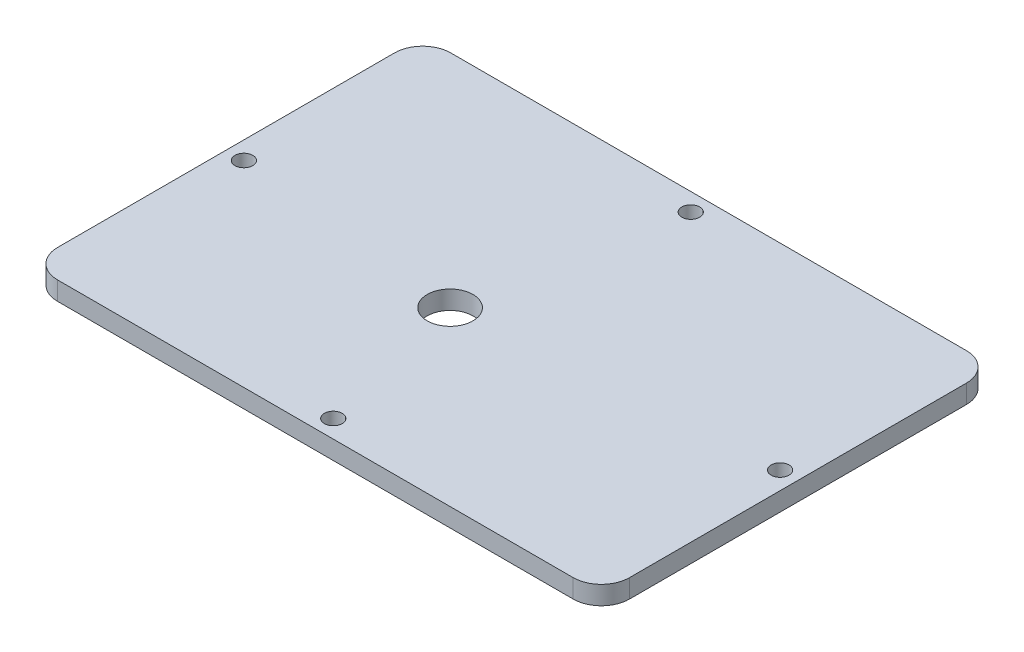
ISO-10303-21;
HEADER;
FILE_DESCRIPTION(('STEP AP214'),'2;1');
FILE_NAME('part.step','',(''),(''),'','','');
FILE_SCHEMA(('AUTOMOTIVE_DESIGN { 1 0 10303 214 1 1 1 1 }'));
ENDSEC;
DATA;
#1=APPLICATION_CONTEXT('core data for automotive mechanical design processes');
#2=APPLICATION_PROTOCOL_DEFINITION('international standard','automotive_design',2000,#1);
#3=PRODUCT_CONTEXT('',#1,'mechanical');
#4=PRODUCT('Part','Part','',(#3));
#5=PRODUCT_RELATED_PRODUCT_CATEGORY('part','',(#4));
#6=PRODUCT_DEFINITION_FORMATION('','',#4);
#7=PRODUCT_DEFINITION_CONTEXT('part definition',#1,'design');
#8=PRODUCT_DEFINITION('design','',#6,#7);
#9=PRODUCT_DEFINITION_SHAPE('','',#8);
#10=(LENGTH_UNIT() NAMED_UNIT(*) SI_UNIT(.MILLI.,.METRE.));
#11=(NAMED_UNIT(*) PLANE_ANGLE_UNIT() SI_UNIT($,.RADIAN.));
#12=(NAMED_UNIT(*) SI_UNIT($,.STERADIAN.) SOLID_ANGLE_UNIT());
#13=UNCERTAINTY_MEASURE_WITH_UNIT(LENGTH_MEASURE(1.E-05),#10,'distance_accuracy_value','');
#14=(GEOMETRIC_REPRESENTATION_CONTEXT(3) GLOBAL_UNCERTAINTY_ASSIGNED_CONTEXT((#13)) GLOBAL_UNIT_ASSIGNED_CONTEXT((#10,
#11,#12)) REPRESENTATION_CONTEXT('',''));
#15=CARTESIAN_POINT('',(0.,0.,0.));
#16=DIRECTION('',(0.,0.,1.));
#17=DIRECTION('',(1.,0.,0.));
#18=AXIS2_PLACEMENT_3D('',#15,#16,#17);
#19=CARTESIAN_POINT('',(50.8,3.302,34.925));
#20=DIRECTION('',(-1.,0.,0.));
#21=DIRECTION('',(0.,0.,1.));
#22=AXIS2_PLACEMENT_3D('',#19,#20,#21);
#23=PLANE('',#22);
#24=DIRECTION('',(0.,0.,-1.));
#25=VECTOR('',#24,1.);
#26=CARTESIAN_POINT('',(50.8,0.,34.925));
#27=LINE('',#26,#25);
#28=CARTESIAN_POINT('',(50.8,0.,29.925));
#29=VERTEX_POINT('',#28);
#30=CARTESIAN_POINT('',(50.8,0.,-29.925));
#31=VERTEX_POINT('',#30);
#32=EDGE_CURVE('E129',#29,#31,#27,.T.);
#33=ORIENTED_EDGE('',*,*,#32,.T.);
#34=DIRECTION('',(0.,-1.,0.));
#35=VECTOR('',#34,1.);
#36=CARTESIAN_POINT('',(50.8,3.302,-29.925));
#37=LINE('',#36,#35);
#38=CARTESIAN_POINT('',(50.8,3.302,-29.925));
#39=VERTEX_POINT('',#38);
#40=EDGE_CURVE('E107',#31,#39,#37,.F.);
#41=ORIENTED_EDGE('',*,*,#40,.T.);
#42=DIRECTION('',(0.,0.,-1.));
#43=VECTOR('',#42,1.);
#44=CARTESIAN_POINT('',(50.8,3.302,34.925));
#45=LINE('',#44,#43);
#46=CARTESIAN_POINT('',(50.8,3.302,29.925));
#47=VERTEX_POINT('',#46);
#48=EDGE_CURVE('E139',#47,#39,#45,.T.);
#49=ORIENTED_EDGE('',*,*,#48,.F.);
#50=DIRECTION('',(0.,-1.,0.));
#51=VECTOR('',#50,1.);
#52=CARTESIAN_POINT('',(50.8,3.302,29.925));
#53=LINE('',#52,#51);
#54=EDGE_CURVE('E112',#47,#29,#53,.T.);
#55=ORIENTED_EDGE('',*,*,#54,.T.);
#56=EDGE_LOOP('',(#33,#41,#49,#55));
#57=FACE_BOUND('',#56,.T.);
#58=ADVANCED_FACE('F36',(#57),#23,.F.);
#59=CARTESIAN_POINT('',(-50.8,3.302,-34.925));
#60=DIRECTION('',(0.,0.,1.));
#61=DIRECTION('',(1.,0.,0.));
#62=AXIS2_PLACEMENT_3D('',#59,#60,#61);
#63=PLANE('',#62);
#64=DIRECTION('',(-1.,0.,0.));
#65=VECTOR('',#64,1.);
#66=CARTESIAN_POINT('',(-50.8,3.302,-34.925));
#67=LINE('',#66,#65);
#68=CARTESIAN_POINT('',(45.8,3.302,-34.925));
#69=VERTEX_POINT('',#68);
#70=CARTESIAN_POINT('',(-45.8,3.302,-34.925));
#71=VERTEX_POINT('',#70);
#72=EDGE_CURVE('E122',#69,#71,#67,.T.);
#73=ORIENTED_EDGE('',*,*,#72,.F.);
#74=DIRECTION('',(0.,-1.,0.));
#75=VECTOR('',#74,1.);
#76=CARTESIAN_POINT('',(45.8,3.302,-34.925));
#77=LINE('',#76,#75);
#78=CARTESIAN_POINT('',(45.8,0.,-34.925));
#79=VERTEX_POINT('',#78);
#80=EDGE_CURVE('E106',#69,#79,#77,.T.);
#81=ORIENTED_EDGE('',*,*,#80,.T.);
#82=DIRECTION('',(-1.,0.,0.));
#83=VECTOR('',#82,1.);
#84=CARTESIAN_POINT('',(-50.8,0.,-34.925));
#85=LINE('',#84,#83);
#86=CARTESIAN_POINT('',(-45.8,0.,-34.925));
#87=VERTEX_POINT('',#86);
#88=EDGE_CURVE('E119',#79,#87,#85,.T.);
#89=ORIENTED_EDGE('',*,*,#88,.T.);
#90=DIRECTION('',(0.,-1.,0.));
#91=VECTOR('',#90,1.);
#92=CARTESIAN_POINT('',(-45.8,3.302,-34.925));
#93=LINE('',#92,#91);
#94=EDGE_CURVE('E124',#87,#71,#93,.F.);
#95=ORIENTED_EDGE('',*,*,#94,.T.);
#96=EDGE_LOOP('',(#73,#81,#89,#95));
#97=FACE_BOUND('',#96,.T.);
#98=ADVANCED_FACE('F118',(#97),#63,.F.);
#99=CARTESIAN_POINT('',(-50.8,3.302,34.925));
#100=DIRECTION('',(1.,0.,0.));
#101=DIRECTION('',(0.,0.,-1.));
#102=AXIS2_PLACEMENT_3D('',#99,#100,#101);
#103=PLANE('',#102);
#104=DIRECTION('',(0.,0.,1.));
#105=VECTOR('',#104,1.);
#106=CARTESIAN_POINT('',(-50.8,0.,34.925));
#107=LINE('',#106,#105);
#108=CARTESIAN_POINT('',(-50.8,0.,-29.925));
#109=VERTEX_POINT('',#108);
#110=CARTESIAN_POINT('',(-50.8,0.,29.925));
#111=VERTEX_POINT('',#110);
#112=EDGE_CURVE('E128',#109,#111,#107,.T.);
#113=ORIENTED_EDGE('',*,*,#112,.T.);
#114=DIRECTION('',(0.,-1.,0.));
#115=VECTOR('',#114,1.);
#116=CARTESIAN_POINT('',(-50.8,3.302,29.925));
#117=LINE('',#116,#115);
#118=CARTESIAN_POINT('',(-50.8,3.302,29.925));
#119=VERTEX_POINT('',#118);
#120=EDGE_CURVE('E11',#111,#119,#117,.F.);
#121=ORIENTED_EDGE('',*,*,#120,.T.);
#122=DIRECTION('',(0.,0.,1.));
#123=VECTOR('',#122,1.);
#124=CARTESIAN_POINT('',(-50.8,3.302,34.925));
#125=LINE('',#124,#123);
#126=CARTESIAN_POINT('',(-50.8,3.302,-29.925));
#127=VERTEX_POINT('',#126);
#128=EDGE_CURVE('E165',#127,#119,#125,.T.);
#129=ORIENTED_EDGE('',*,*,#128,.F.);
#130=DIRECTION('',(0.,-1.,0.));
#131=VECTOR('',#130,1.);
#132=CARTESIAN_POINT('',(-50.8,3.302,-29.925));
#133=LINE('',#132,#131);
#134=EDGE_CURVE('E44',#127,#109,#133,.T.);
#135=ORIENTED_EDGE('',*,*,#134,.T.);
#136=EDGE_LOOP('',(#113,#121,#129,#135));
#137=FACE_BOUND('',#136,.T.);
#138=ADVANCED_FACE('F163',(#137),#103,.F.);
#139=CARTESIAN_POINT('',(-50.8,3.302,34.925));
#140=DIRECTION('',(0.,0.,-1.));
#141=DIRECTION('',(-1.,0.,0.));
#142=AXIS2_PLACEMENT_3D('',#139,#140,#141);
#143=PLANE('',#142);
#144=DIRECTION('',(1.,0.,0.));
#145=VECTOR('',#144,1.);
#146=CARTESIAN_POINT('',(-50.8,0.,34.925));
#147=LINE('',#146,#145);
#148=CARTESIAN_POINT('',(-45.8,0.,34.925));
#149=VERTEX_POINT('',#148);
#150=CARTESIAN_POINT('',(45.8,0.,34.925));
#151=VERTEX_POINT('',#150);
#152=EDGE_CURVE('E132',#149,#151,#147,.T.);
#153=ORIENTED_EDGE('',*,*,#152,.T.);
#154=DIRECTION('',(0.,-1.,0.));
#155=VECTOR('',#154,1.);
#156=CARTESIAN_POINT('',(45.8,3.302,34.925));
#157=LINE('',#156,#155);
#158=CARTESIAN_POINT('',(45.8,3.302,34.925));
#159=VERTEX_POINT('',#158);
#160=EDGE_CURVE('E51',#151,#159,#157,.F.);
#161=ORIENTED_EDGE('',*,*,#160,.T.);
#162=DIRECTION('',(1.,0.,0.));
#163=VECTOR('',#162,1.);
#164=CARTESIAN_POINT('',(-50.8,3.302,34.925));
#165=LINE('',#164,#163);
#166=CARTESIAN_POINT('',(-45.8,3.302,34.925));
#167=VERTEX_POINT('',#166);
#168=EDGE_CURVE('E140',#167,#159,#165,.T.);
#169=ORIENTED_EDGE('',*,*,#168,.F.);
#170=DIRECTION('',(0.,-1.,0.));
#171=VECTOR('',#170,1.);
#172=CARTESIAN_POINT('',(-45.8,3.302,34.925));
#173=LINE('',#172,#171);
#174=EDGE_CURVE('E156',#167,#149,#173,.T.);
#175=ORIENTED_EDGE('',*,*,#174,.T.);
#176=EDGE_LOOP('',(#153,#161,#169,#175));
#177=FACE_BOUND('',#176,.T.);
#178=ADVANCED_FACE('F172',(#177),#143,.F.);
#179=CARTESIAN_POINT('',(0.,3.302,0.));
#180=DIRECTION('',(0.,-1.,0.));
#181=DIRECTION('',(0.,0.,-1.));
#182=AXIS2_PLACEMENT_3D('',#179,#180,#181);
#183=PLANE('',#182);
#184=CARTESIAN_POINT('',(-6.67140678932045,3.302,4.32832643580255));
#185=DIRECTION('',(0.,1.,0.));
#186=DIRECTION('',(0.,0.,1.));
#187=AXIS2_PLACEMENT_3D('',#184,#185,#186);
#188=CIRCLE('',#187,4.064);
#189=CARTESIAN_POINT('',(-6.67140678932045,3.302,8.39232643580255));
#190=VERTEX_POINT('',#189);
#191=EDGE_CURVE('E203',#190,#190,#188,.T.);
#192=ORIENTED_EDGE('',*,*,#191,.F.);
#193=EDGE_LOOP('',(#192));
#194=FACE_BOUND('',#193,.T.);
#195=CARTESIAN_POINT('',(0.,3.302,-31.75));
#196=DIRECTION('',(0.,-1.,0.));
#197=DIRECTION('',(0.,0.,-1.));
#198=AXIS2_PLACEMENT_3D('',#195,#196,#197);
#199=CIRCLE('',#198,1.5875);
#200=CARTESIAN_POINT('',(0.,3.302,-33.3375));
#201=VERTEX_POINT('',#200);
#202=EDGE_CURVE('E134',#201,#201,#199,.T.);
#203=ORIENTED_EDGE('',*,*,#202,.T.);
#204=EDGE_LOOP('',(#203));
#205=FACE_BOUND('',#204,.T.);
#206=CARTESIAN_POINT('',(47.625,3.302,0.));
#207=DIRECTION('',(0.,-1.,0.));
#208=DIRECTION('',(0.,0.,-1.));
#209=AXIS2_PLACEMENT_3D('',#206,#207,#208);
#210=CIRCLE('',#209,1.5875);
#211=CARTESIAN_POINT('',(47.625,3.302,-1.58749999999999));
#212=VERTEX_POINT('',#211);
#213=EDGE_CURVE('E195',#212,#212,#210,.T.);
#214=ORIENTED_EDGE('',*,*,#213,.T.);
#215=EDGE_LOOP('',(#214));
#216=FACE_BOUND('',#215,.T.);
#217=CARTESIAN_POINT('',(0.,3.302,31.75));
#218=DIRECTION('',(0.,-1.,0.));
#219=DIRECTION('',(0.,0.,-1.));
#220=AXIS2_PLACEMENT_3D('',#217,#218,#219);
#221=CIRCLE('',#220,1.5875);
#222=CARTESIAN_POINT('',(0.,3.302,30.1625));
#223=VERTEX_POINT('',#222);
#224=EDGE_CURVE('E189',#223,#223,#221,.T.);
#225=ORIENTED_EDGE('',*,*,#224,.T.);
#226=EDGE_LOOP('',(#225));
#227=FACE_BOUND('',#226,.T.);
#228=CARTESIAN_POINT('',(-47.625,3.302,0.));
#229=DIRECTION('',(0.,-1.,0.));
#230=DIRECTION('',(0.,0.,-1.));
#231=AXIS2_PLACEMENT_3D('',#228,#229,#230);
#232=CIRCLE('',#231,1.5875);
#233=CARTESIAN_POINT('',(-47.625,3.302,-1.58750000000001));
#234=VERTEX_POINT('',#233);
#235=EDGE_CURVE('E182',#234,#234,#232,.T.);
#236=ORIENTED_EDGE('',*,*,#235,.T.);
#237=EDGE_LOOP('',(#236));
#238=FACE_BOUND('',#237,.T.);
#239=ORIENTED_EDGE('',*,*,#48,.T.);
#240=CARTESIAN_POINT('',(45.8,3.302,-29.925));
#241=DIRECTION('',(0.,-1.,0.));
#242=DIRECTION('',(0.,0.,-1.));
#243=AXIS2_PLACEMENT_3D('',#240,#241,#242);
#244=CIRCLE('',#243,5.);
#245=EDGE_CURVE('E154',#39,#69,#244,.F.);
#246=ORIENTED_EDGE('',*,*,#245,.T.);
#247=ORIENTED_EDGE('',*,*,#72,.T.);
#248=CARTESIAN_POINT('',(-45.8,3.302,-29.925));
#249=DIRECTION('',(0.,-1.,0.));
#250=DIRECTION('',(0.,0.,-1.));
#251=AXIS2_PLACEMENT_3D('',#248,#249,#250);
#252=CIRCLE('',#251,5.);
#253=EDGE_CURVE('E149',#71,#127,#252,.F.);
#254=ORIENTED_EDGE('',*,*,#253,.T.);
#255=ORIENTED_EDGE('',*,*,#128,.T.);
#256=CARTESIAN_POINT('',(-45.8,3.302,29.925));
#257=DIRECTION('',(0.,-1.,0.));
#258=DIRECTION('',(0.,0.,-1.));
#259=AXIS2_PLACEMENT_3D('',#256,#257,#258);
#260=CIRCLE('',#259,5.);
#261=EDGE_CURVE('E58',#119,#167,#260,.F.);
#262=ORIENTED_EDGE('',*,*,#261,.T.);
#263=ORIENTED_EDGE('',*,*,#168,.T.);
#264=CARTESIAN_POINT('',(45.8,3.302,29.925));
#265=DIRECTION('',(0.,-1.,0.));
#266=DIRECTION('',(0.,0.,-1.));
#267=AXIS2_PLACEMENT_3D('',#264,#265,#266);
#268=CIRCLE('',#267,5.);
#269=EDGE_CURVE('E152',#159,#47,#268,.F.);
#270=ORIENTED_EDGE('',*,*,#269,.T.);
#271=EDGE_LOOP('',(#239,#246,#247,#254,#255,#262,#263,#270));
#272=FACE_BOUND('',#271,.T.);
#273=ADVANCED_FACE('F217',(#194,#205,#216,#227,#238,#272),#183,.F.);
#274=CARTESIAN_POINT('',(0.,0.,0.));
#275=DIRECTION('',(0.,-1.,0.));
#276=DIRECTION('',(0.,0.,-1.));
#277=AXIS2_PLACEMENT_3D('',#274,#275,#276);
#278=PLANE('',#277);
#279=CARTESIAN_POINT('',(-6.67140678932045,0.,4.32832643580255));
#280=DIRECTION('',(0.,1.,0.));
#281=DIRECTION('',(0.,0.,1.));
#282=AXIS2_PLACEMENT_3D('',#279,#280,#281);
#283=CIRCLE('',#282,4.064);
#284=CARTESIAN_POINT('',(-6.67140678932045,0.,8.39232643580255));
#285=VERTEX_POINT('',#284);
#286=EDGE_CURVE('E183',#285,#285,#283,.T.);
#287=ORIENTED_EDGE('',*,*,#286,.T.);
#288=EDGE_LOOP('',(#287));
#289=FACE_BOUND('',#288,.T.);
#290=CARTESIAN_POINT('',(0.,0.,-31.75));
#291=DIRECTION('',(0.,-1.,0.));
#292=DIRECTION('',(0.,0.,-1.));
#293=AXIS2_PLACEMENT_3D('',#290,#291,#292);
#294=CIRCLE('',#293,1.5875);
#295=CARTESIAN_POINT('',(0.,0.,-33.3375));
#296=VERTEX_POINT('',#295);
#297=EDGE_CURVE('E198',#296,#296,#294,.T.);
#298=ORIENTED_EDGE('',*,*,#297,.F.);
#299=EDGE_LOOP('',(#298));
#300=FACE_BOUND('',#299,.T.);
#301=CARTESIAN_POINT('',(47.625,0.,0.));
#302=DIRECTION('',(0.,-1.,0.));
#303=DIRECTION('',(0.,0.,-1.));
#304=AXIS2_PLACEMENT_3D('',#301,#302,#303);
#305=CIRCLE('',#304,1.5875);
#306=CARTESIAN_POINT('',(47.625,0.,-1.58749999999999));
#307=VERTEX_POINT('',#306);
#308=EDGE_CURVE('E192',#307,#307,#305,.T.);
#309=ORIENTED_EDGE('',*,*,#308,.F.);
#310=EDGE_LOOP('',(#309));
#311=FACE_BOUND('',#310,.T.);
#312=CARTESIAN_POINT('',(0.,0.,31.75));
#313=DIRECTION('',(0.,-1.,0.));
#314=DIRECTION('',(0.,0.,-1.));
#315=AXIS2_PLACEMENT_3D('',#312,#313,#314);
#316=CIRCLE('',#315,1.5875);
#317=CARTESIAN_POINT('',(0.,0.,30.1625));
#318=VERTEX_POINT('',#317);
#319=EDGE_CURVE('E186',#318,#318,#316,.T.);
#320=ORIENTED_EDGE('',*,*,#319,.F.);
#321=EDGE_LOOP('',(#320));
#322=FACE_BOUND('',#321,.T.);
#323=CARTESIAN_POINT('',(-47.625,0.,0.));
#324=DIRECTION('',(0.,-1.,0.));
#325=DIRECTION('',(0.,0.,-1.));
#326=AXIS2_PLACEMENT_3D('',#323,#324,#325);
#327=CIRCLE('',#326,1.5875);
#328=CARTESIAN_POINT('',(-47.625,0.,-1.58750000000001));
#329=VERTEX_POINT('',#328);
#330=EDGE_CURVE('E179',#329,#329,#327,.T.);
#331=ORIENTED_EDGE('',*,*,#330,.F.);
#332=EDGE_LOOP('',(#331));
#333=FACE_BOUND('',#332,.T.);
#334=ORIENTED_EDGE('',*,*,#88,.F.);
#335=CARTESIAN_POINT('',(45.8,0.,-29.925));
#336=DIRECTION('',(0.,-1.,0.));
#337=DIRECTION('',(0.,0.,-1.));
#338=AXIS2_PLACEMENT_3D('',#335,#336,#337);
#339=CIRCLE('',#338,5.);
#340=EDGE_CURVE('E102',#79,#31,#339,.T.);
#341=ORIENTED_EDGE('',*,*,#340,.T.);
#342=ORIENTED_EDGE('',*,*,#32,.F.);
#343=CARTESIAN_POINT('',(45.8,0.,29.925));
#344=DIRECTION('',(0.,-1.,0.));
#345=DIRECTION('',(0.,0.,-1.));
#346=AXIS2_PLACEMENT_3D('',#343,#344,#345);
#347=CIRCLE('',#346,5.);
#348=EDGE_CURVE('E113',#29,#151,#347,.T.);
#349=ORIENTED_EDGE('',*,*,#348,.T.);
#350=ORIENTED_EDGE('',*,*,#152,.F.);
#351=CARTESIAN_POINT('',(-45.8,0.,29.925));
#352=DIRECTION('',(0.,-1.,0.));
#353=DIRECTION('',(0.,0.,-1.));
#354=AXIS2_PLACEMENT_3D('',#351,#352,#353);
#355=CIRCLE('',#354,5.);
#356=EDGE_CURVE('E143',#149,#111,#355,.T.);
#357=ORIENTED_EDGE('',*,*,#356,.T.);
#358=ORIENTED_EDGE('',*,*,#112,.F.);
#359=CARTESIAN_POINT('',(-45.8,0.,-29.925));
#360=DIRECTION('',(0.,-1.,0.));
#361=DIRECTION('',(0.,0.,-1.));
#362=AXIS2_PLACEMENT_3D('',#359,#360,#361);
#363=CIRCLE('',#362,5.);
#364=EDGE_CURVE('E123',#109,#87,#363,.T.);
#365=ORIENTED_EDGE('',*,*,#364,.T.);
#366=EDGE_LOOP('',(#334,#341,#342,#349,#350,#357,#358,#365));
#367=FACE_BOUND('',#366,.T.);
#368=ADVANCED_FACE('F126',(#289,#300,#311,#322,#333,#367),#278,.T.);
#369=CARTESIAN_POINT('',(-47.625,3.302,0.));
#370=DIRECTION('',(0.,-1.,0.));
#371=DIRECTION('',(0.,0.,-1.));
#372=AXIS2_PLACEMENT_3D('',#369,#370,#371);
#373=CYLINDRICAL_SURFACE('',#372,1.5875);
#374=ORIENTED_EDGE('',*,*,#235,.F.);
#375=EDGE_LOOP('',(#374));
#376=FACE_BOUND('',#375,.T.);
#377=ORIENTED_EDGE('',*,*,#330,.T.);
#378=EDGE_LOOP('',(#377));
#379=FACE_BOUND('',#378,.T.);
#380=ADVANCED_FACE('F253',(#376,#379),#373,.F.);
#381=CARTESIAN_POINT('',(0.,3.302,31.75));
#382=DIRECTION('',(0.,-1.,0.));
#383=DIRECTION('',(0.,0.,-1.));
#384=AXIS2_PLACEMENT_3D('',#381,#382,#383);
#385=CYLINDRICAL_SURFACE('',#384,1.5875);
#386=ORIENTED_EDGE('',*,*,#224,.F.);
#387=EDGE_LOOP('',(#386));
#388=FACE_BOUND('',#387,.T.);
#389=ORIENTED_EDGE('',*,*,#319,.T.);
#390=EDGE_LOOP('',(#389));
#391=FACE_BOUND('',#390,.T.);
#392=ADVANCED_FACE('F257',(#388,#391),#385,.F.);
#393=CARTESIAN_POINT('',(47.625,3.302,0.));
#394=DIRECTION('',(0.,-1.,0.));
#395=DIRECTION('',(0.,0.,-1.));
#396=AXIS2_PLACEMENT_3D('',#393,#394,#395);
#397=CYLINDRICAL_SURFACE('',#396,1.5875);
#398=ORIENTED_EDGE('',*,*,#213,.F.);
#399=EDGE_LOOP('',(#398));
#400=FACE_BOUND('',#399,.T.);
#401=ORIENTED_EDGE('',*,*,#308,.T.);
#402=EDGE_LOOP('',(#401));
#403=FACE_BOUND('',#402,.T.);
#404=ADVANCED_FACE('F261',(#400,#403),#397,.F.);
#405=CARTESIAN_POINT('',(0.,3.302,-31.75));
#406=DIRECTION('',(0.,-1.,0.));
#407=DIRECTION('',(0.,0.,-1.));
#408=AXIS2_PLACEMENT_3D('',#405,#406,#407);
#409=CYLINDRICAL_SURFACE('',#408,1.5875);
#410=ORIENTED_EDGE('',*,*,#202,.F.);
#411=EDGE_LOOP('',(#410));
#412=FACE_BOUND('',#411,.T.);
#413=ORIENTED_EDGE('',*,*,#297,.T.);
#414=EDGE_LOOP('',(#413));
#415=FACE_BOUND('',#414,.T.);
#416=ADVANCED_FACE('F239',(#412,#415),#409,.F.);
#417=CARTESIAN_POINT('',(45.8,3.302,-29.925));
#418=DIRECTION('',(0.,-1.,0.));
#419=DIRECTION('',(0.,0.,-1.));
#420=AXIS2_PLACEMENT_3D('',#417,#418,#419);
#421=CYLINDRICAL_SURFACE('',#420,5.);
#422=ORIENTED_EDGE('',*,*,#245,.F.);
#423=ORIENTED_EDGE('',*,*,#40,.F.);
#424=ORIENTED_EDGE('',*,*,#340,.F.);
#425=ORIENTED_EDGE('',*,*,#80,.F.);
#426=EDGE_LOOP('',(#422,#423,#424,#425));
#427=FACE_BOUND('',#426,.T.);
#428=ADVANCED_FACE('F105',(#427),#421,.T.);
#429=CARTESIAN_POINT('',(45.8,3.302,29.925));
#430=DIRECTION('',(0.,-1.,0.));
#431=DIRECTION('',(0.,0.,-1.));
#432=AXIS2_PLACEMENT_3D('',#429,#430,#431);
#433=CYLINDRICAL_SURFACE('',#432,5.);
#434=ORIENTED_EDGE('',*,*,#269,.F.);
#435=ORIENTED_EDGE('',*,*,#160,.F.);
#436=ORIENTED_EDGE('',*,*,#348,.F.);
#437=ORIENTED_EDGE('',*,*,#54,.F.);
#438=EDGE_LOOP('',(#434,#435,#436,#437));
#439=FACE_BOUND('',#438,.T.);
#440=ADVANCED_FACE('F232',(#439),#433,.T.);
#441=CARTESIAN_POINT('',(-45.8,3.302,29.925));
#442=DIRECTION('',(0.,-1.,0.));
#443=DIRECTION('',(0.,0.,-1.));
#444=AXIS2_PLACEMENT_3D('',#441,#442,#443);
#445=CYLINDRICAL_SURFACE('',#444,5.);
#446=ORIENTED_EDGE('',*,*,#261,.F.);
#447=ORIENTED_EDGE('',*,*,#120,.F.);
#448=ORIENTED_EDGE('',*,*,#356,.F.);
#449=ORIENTED_EDGE('',*,*,#174,.F.);
#450=EDGE_LOOP('',(#446,#447,#448,#449));
#451=FACE_BOUND('',#450,.T.);
#452=ADVANCED_FACE('F171',(#451),#445,.T.);
#453=CARTESIAN_POINT('',(-45.8,3.302,-29.925));
#454=DIRECTION('',(0.,-1.,0.));
#455=DIRECTION('',(0.,0.,-1.));
#456=AXIS2_PLACEMENT_3D('',#453,#454,#455);
#457=CYLINDRICAL_SURFACE('',#456,5.);
#458=ORIENTED_EDGE('',*,*,#253,.F.);
#459=ORIENTED_EDGE('',*,*,#94,.F.);
#460=ORIENTED_EDGE('',*,*,#364,.F.);
#461=ORIENTED_EDGE('',*,*,#134,.F.);
#462=EDGE_LOOP('',(#458,#459,#460,#461));
#463=FACE_BOUND('',#462,.T.);
#464=ADVANCED_FACE('F38',(#463),#457,.T.);
#465=CARTESIAN_POINT('',(-6.67140678932045,0.,4.32832643580255));
#466=DIRECTION('',(0.,1.,0.));
#467=DIRECTION('',(0.,0.,1.));
#468=AXIS2_PLACEMENT_3D('',#465,#466,#467);
#469=CYLINDRICAL_SURFACE('',#468,4.064);
#470=ORIENTED_EDGE('',*,*,#286,.F.);
#471=EDGE_LOOP('',(#470));
#472=FACE_BOUND('',#471,.T.);
#473=ORIENTED_EDGE('',*,*,#191,.T.);
#474=EDGE_LOOP('',(#473));
#475=FACE_BOUND('',#474,.T.);
#476=ADVANCED_FACE('F211',(#472,#475),#469,.F.);
#477=CLOSED_SHELL('',(#58,#98,#138,#178,#273,#368,#380,#392,#404,#416,#428,#440,#452,#464,#476));
#478=MANIFOLD_SOLID_BREP('B2',#477);
#479=ADVANCED_BREP_SHAPE_REPRESENTATION('',(#18,#478),#14);
#480=SHAPE_DEFINITION_REPRESENTATION(#9,#479);
ENDSEC;
END-ISO-10303-21;
